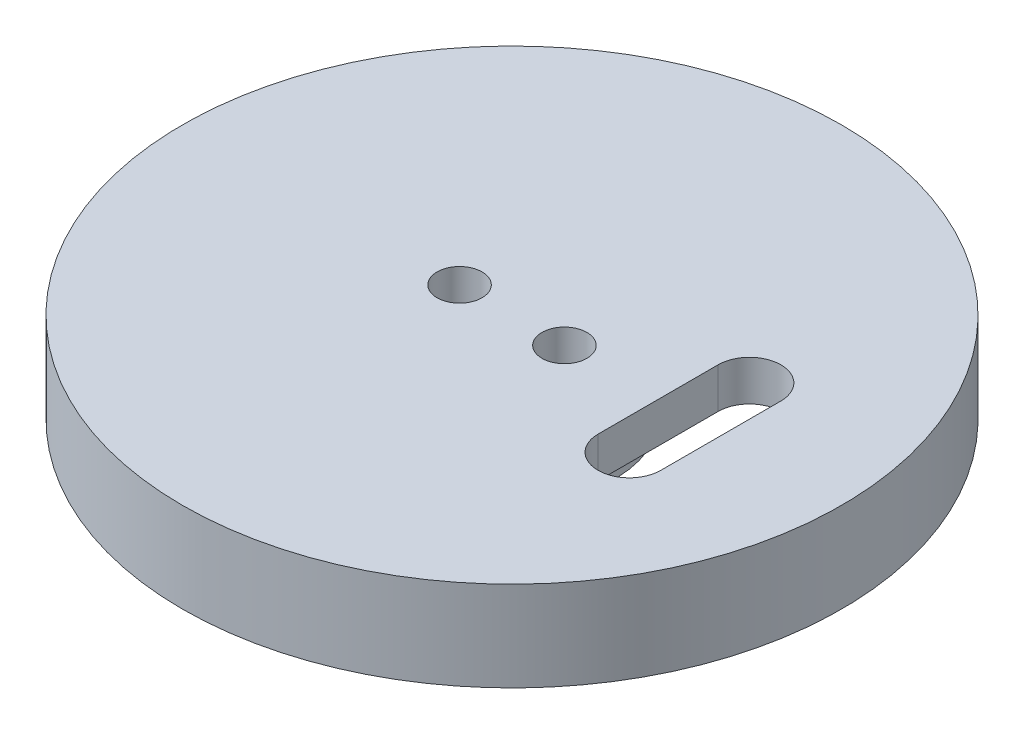
ISO-10303-21;
HEADER;
FILE_DESCRIPTION(('STEP AP214'),'2;1');
FILE_NAME('part.step','',(''),(''),'','','');
FILE_SCHEMA(('AUTOMOTIVE_DESIGN { 1 0 10303 214 1 1 1 1 }'));
ENDSEC;
DATA;
#1=APPLICATION_CONTEXT('core data for automotive mechanical design processes');
#2=APPLICATION_PROTOCOL_DEFINITION('international standard','automotive_design',2000,#1);
#3=PRODUCT_CONTEXT('',#1,'mechanical');
#4=PRODUCT('Part','Part','',(#3));
#5=PRODUCT_RELATED_PRODUCT_CATEGORY('part','',(#4));
#6=PRODUCT_DEFINITION_FORMATION('','',#4);
#7=PRODUCT_DEFINITION_CONTEXT('part definition',#1,'design');
#8=PRODUCT_DEFINITION('design','',#6,#7);
#9=PRODUCT_DEFINITION_SHAPE('','',#8);
#10=(LENGTH_UNIT() NAMED_UNIT(*) SI_UNIT(.MILLI.,.METRE.));
#11=(NAMED_UNIT(*) PLANE_ANGLE_UNIT() SI_UNIT($,.RADIAN.));
#12=(NAMED_UNIT(*) SI_UNIT($,.STERADIAN.) SOLID_ANGLE_UNIT());
#13=UNCERTAINTY_MEASURE_WITH_UNIT(LENGTH_MEASURE(1.E-05),#10,'distance_accuracy_value','');
#14=(GEOMETRIC_REPRESENTATION_CONTEXT(3) GLOBAL_UNCERTAINTY_ASSIGNED_CONTEXT((#13)) GLOBAL_UNIT_ASSIGNED_CONTEXT((#10,
#11,#12)) REPRESENTATION_CONTEXT('',''));
#15=CARTESIAN_POINT('',(0.,0.,0.));
#16=DIRECTION('',(0.,0.,1.));
#17=DIRECTION('',(1.,0.,0.));
#18=AXIS2_PLACEMENT_3D('',#15,#16,#17);
#19=CARTESIAN_POINT('',(0.,0.,0.));
#20=DIRECTION('',(0.,1.,0.));
#21=DIRECTION('',(0.,0.,1.));
#22=AXIS2_PLACEMENT_3D('',#19,#20,#21);
#23=PLANE('',#22);
#24=CARTESIAN_POINT('',(3.5,0.,0.));
#25=DIRECTION('',(0.,1.,0.));
#26=DIRECTION('',(0.,0.,1.));
#27=AXIS2_PLACEMENT_3D('',#24,#25,#26);
#28=CIRCLE('',#27,1.5);
#29=CARTESIAN_POINT('',(3.5,0.,1.5));
#30=VERTEX_POINT('',#29);
#31=EDGE_CURVE('E118',#30,#30,#28,.T.);
#32=ORIENTED_EDGE('',*,*,#31,.T.);
#33=EDGE_LOOP('',(#32));
#34=FACE_BOUND('',#33,.T.);
#35=CARTESIAN_POINT('',(-3.5,0.,0.));
#36=DIRECTION('',(0.,1.,0.));
#37=DIRECTION('',(0.,0.,1.));
#38=AXIS2_PLACEMENT_3D('',#35,#36,#37);
#39=CIRCLE('',#38,1.5);
#40=CARTESIAN_POINT('',(-3.5,0.,1.5));
#41=VERTEX_POINT('',#40);
#42=EDGE_CURVE('E124',#41,#41,#39,.T.);
#43=ORIENTED_EDGE('',*,*,#42,.T.);
#44=EDGE_LOOP('',(#43));
#45=FACE_BOUND('',#44,.T.);
#46=CARTESIAN_POINT('',(0.,0.,0.));
#47=DIRECTION('',(0.,-1.,0.));
#48=DIRECTION('',(0.,0.,-1.));
#49=AXIS2_PLACEMENT_3D('',#46,#47,#48);
#50=CIRCLE('',#49,6.9);
#51=CARTESIAN_POINT('',(0.,0.,-6.9));
#52=VERTEX_POINT('',#51);
#53=EDGE_CURVE('E108',#52,#52,#50,.T.);
#54=ORIENTED_EDGE('',*,*,#53,.T.);
#55=EDGE_LOOP('',(#54));
#56=FACE_BOUND('',#55,.T.);
#57=ADVANCED_FACE('F32',(#34,#45,#56),#23,.F.);
#58=CARTESIAN_POINT('',(0.,6.,0.));
#59=DIRECTION('',(0.,1.,0.));
#60=DIRECTION('',(0.,0.,1.));
#61=AXIS2_PLACEMENT_3D('',#58,#59,#60);
#62=PLANE('',#61);
#63=CARTESIAN_POINT('',(11.8461461549811,6.,4.00867964586304));
#64=DIRECTION('',(0.,1.,0.));
#65=DIRECTION('',(0.,0.,1.));
#66=AXIS2_PLACEMENT_3D('',#63,#64,#65);
#67=CIRCLE('',#66,2.09447963747971);
#68=CARTESIAN_POINT('',(9.75166651750136,6.,4.00867964586304));
#69=VERTEX_POINT('',#68);
#70=CARTESIAN_POINT('',(13.9406257924608,6.,4.00867964586304));
#71=VERTEX_POINT('',#70);
#72=EDGE_CURVE('E106',#69,#71,#67,.T.);
#73=ORIENTED_EDGE('',*,*,#72,.F.);
#74=DIRECTION('',(0.,0.,1.));
#75=VECTOR('',#74,1.);
#76=CARTESIAN_POINT('',(9.75166651750136,6.,0.));
#77=LINE('',#76,#75);
#78=CARTESIAN_POINT('',(9.75166651750136,6.,-4.00867964586304));
#79=VERTEX_POINT('',#78);
#80=EDGE_CURVE('E99',#79,#69,#77,.T.);
#81=ORIENTED_EDGE('',*,*,#80,.F.);
#82=CARTESIAN_POINT('',(11.8461461549811,6.,-4.00867964586304));
#83=DIRECTION('',(0.,1.,0.));
#84=DIRECTION('',(0.,0.,1.));
#85=AXIS2_PLACEMENT_3D('',#82,#83,#84);
#86=CIRCLE('',#85,2.09447963747971);
#87=CARTESIAN_POINT('',(13.9406257924608,6.,-4.00867964586304));
#88=VERTEX_POINT('',#87);
#89=EDGE_CURVE('E79',#88,#79,#86,.T.);
#90=ORIENTED_EDGE('',*,*,#89,.F.);
#91=DIRECTION('',(0.,0.,-1.));
#92=VECTOR('',#91,1.);
#93=CARTESIAN_POINT('',(13.9406257924608,6.,0.));
#94=LINE('',#93,#92);
#95=EDGE_CURVE('E104',#71,#88,#94,.T.);
#96=ORIENTED_EDGE('',*,*,#95,.F.);
#97=EDGE_LOOP('',(#73,#81,#90,#96));
#98=FACE_BOUND('',#97,.T.);
#99=CARTESIAN_POINT('',(-3.5,6.,0.));
#100=DIRECTION('',(0.,1.,0.));
#101=DIRECTION('',(0.,0.,1.));
#102=AXIS2_PLACEMENT_3D('',#99,#100,#101);
#103=CIRCLE('',#102,1.5);
#104=CARTESIAN_POINT('',(-3.5,6.,1.5));
#105=VERTEX_POINT('',#104);
#106=EDGE_CURVE('E127',#105,#105,#103,.T.);
#107=ORIENTED_EDGE('',*,*,#106,.F.);
#108=EDGE_LOOP('',(#107));
#109=FACE_BOUND('',#108,.T.);
#110=CARTESIAN_POINT('',(0.,6.,0.));
#111=DIRECTION('',(0.,1.,0.));
#112=DIRECTION('',(0.,0.,1.));
#113=AXIS2_PLACEMENT_3D('',#110,#111,#112);
#114=CIRCLE('',#113,22.);
#115=CARTESIAN_POINT('',(0.,6.,22.));
#116=VERTEX_POINT('',#115);
#117=EDGE_CURVE('E11',#116,#116,#114,.T.);
#118=ORIENTED_EDGE('',*,*,#117,.T.);
#119=EDGE_LOOP('',(#118));
#120=FACE_BOUND('',#119,.T.);
#121=CARTESIAN_POINT('',(3.5,6.,0.));
#122=DIRECTION('',(0.,1.,0.));
#123=DIRECTION('',(0.,0.,1.));
#124=AXIS2_PLACEMENT_3D('',#121,#122,#123);
#125=CIRCLE('',#124,1.5);
#126=CARTESIAN_POINT('',(3.5,6.,1.5));
#127=VERTEX_POINT('',#126);
#128=EDGE_CURVE('E121',#127,#127,#125,.T.);
#129=ORIENTED_EDGE('',*,*,#128,.F.);
#130=EDGE_LOOP('',(#129));
#131=FACE_BOUND('',#130,.T.);
#132=ADVANCED_FACE('F151',(#98,#109,#120,#131),#62,.T.);
#133=CARTESIAN_POINT('',(0.,0.,0.));
#134=DIRECTION('',(0.,-1.,0.));
#135=DIRECTION('',(0.,0.,-1.));
#136=AXIS2_PLACEMENT_3D('',#133,#134,#135);
#137=CIRCLE('',#136,16.25);
#138=CARTESIAN_POINT('',(0.,0.,-16.25));
#139=VERTEX_POINT('',#138);
#140=EDGE_CURVE('E112',#139,#139,#137,.T.);
#141=ORIENTED_EDGE('',*,*,#140,.F.);
#142=EDGE_LOOP('',(#141));
#143=FACE_BOUND('',#142,.T.);
#144=CARTESIAN_POINT('',(0.,0.,0.));
#145=DIRECTION('',(0.,1.,0.));
#146=DIRECTION('',(0.,0.,1.));
#147=AXIS2_PLACEMENT_3D('',#144,#145,#146);
#148=CIRCLE('',#147,22.);
#149=CARTESIAN_POINT('',(0.,0.,22.));
#150=VERTEX_POINT('',#149);
#151=EDGE_CURVE('E36',#150,#150,#148,.T.);
#152=ORIENTED_EDGE('',*,*,#151,.F.);
#153=EDGE_LOOP('',(#152));
#154=FACE_BOUND('',#153,.T.);
#155=ADVANCED_FACE('F147',(#143,#154),#23,.F.);
#156=CARTESIAN_POINT('',(0.,6.,0.));
#157=DIRECTION('',(0.,-1.,0.));
#158=DIRECTION('',(0.,0.,-1.));
#159=AXIS2_PLACEMENT_3D('',#156,#157,#158);
#160=CYLINDRICAL_SURFACE('',#159,22.);
#161=ORIENTED_EDGE('',*,*,#117,.F.);
#162=EDGE_LOOP('',(#161));
#163=FACE_BOUND('',#162,.T.);
#164=ORIENTED_EDGE('',*,*,#151,.T.);
#165=EDGE_LOOP('',(#164));
#166=FACE_BOUND('',#165,.T.);
#167=ADVANCED_FACE('F34',(#163,#166),#160,.T.);
#168=CARTESIAN_POINT('',(-3.5,6.,0.));
#169=DIRECTION('',(0.,-1.,0.));
#170=DIRECTION('',(0.,0.,-1.));
#171=AXIS2_PLACEMENT_3D('',#168,#169,#170);
#172=CYLINDRICAL_SURFACE('',#171,1.5);
#173=ORIENTED_EDGE('',*,*,#106,.T.);
#174=EDGE_LOOP('',(#173));
#175=FACE_BOUND('',#174,.T.);
#176=ORIENTED_EDGE('',*,*,#42,.F.);
#177=EDGE_LOOP('',(#176));
#178=FACE_BOUND('',#177,.T.);
#179=ADVANCED_FACE('F135',(#175,#178),#172,.F.);
#180=CARTESIAN_POINT('',(3.5,6.,0.));
#181=DIRECTION('',(0.,-1.,0.));
#182=DIRECTION('',(0.,0.,-1.));
#183=AXIS2_PLACEMENT_3D('',#180,#181,#182);
#184=CYLINDRICAL_SURFACE('',#183,1.5);
#185=ORIENTED_EDGE('',*,*,#128,.T.);
#186=EDGE_LOOP('',(#185));
#187=FACE_BOUND('',#186,.T.);
#188=ORIENTED_EDGE('',*,*,#31,.F.);
#189=EDGE_LOOP('',(#188));
#190=FACE_BOUND('',#189,.T.);
#191=ADVANCED_FACE('F137',(#187,#190),#184,.F.);
#192=CARTESIAN_POINT('',(0.,3.3,0.));
#193=DIRECTION('',(0.,-1.,0.));
#194=DIRECTION('',(0.,0.,-1.));
#195=AXIS2_PLACEMENT_3D('',#192,#193,#194);
#196=CYLINDRICAL_SURFACE('',#195,16.25);
#197=CARTESIAN_POINT('',(0.,3.3,0.));
#198=DIRECTION('',(0.,-1.,0.));
#199=DIRECTION('',(0.,0.,-1.));
#200=AXIS2_PLACEMENT_3D('',#197,#198,#199);
#201=CIRCLE('',#200,16.25);
#202=CARTESIAN_POINT('',(0.,3.3,-16.25));
#203=VERTEX_POINT('',#202);
#204=EDGE_CURVE('E115',#203,#203,#201,.T.);
#205=ORIENTED_EDGE('',*,*,#204,.F.);
#206=EDGE_LOOP('',(#205));
#207=FACE_BOUND('',#206,.T.);
#208=ORIENTED_EDGE('',*,*,#140,.T.);
#209=EDGE_LOOP('',(#208));
#210=FACE_BOUND('',#209,.T.);
#211=ADVANCED_FACE('F144',(#207,#210),#196,.F.);
#212=CARTESIAN_POINT('',(0.,3.3,0.));
#213=DIRECTION('',(0.,-1.,0.));
#214=DIRECTION('',(0.,0.,-1.));
#215=AXIS2_PLACEMENT_3D('',#212,#213,#214);
#216=PLANE('',#215);
#217=CARTESIAN_POINT('',(11.8461461549811,3.3,4.00867964586304));
#218=DIRECTION('',(0.,-1.,0.));
#219=DIRECTION('',(0.,0.,-1.));
#220=AXIS2_PLACEMENT_3D('',#217,#218,#219);
#221=CIRCLE('',#220,2.09447963747971);
#222=CARTESIAN_POINT('',(13.9406257924608,3.3,4.00867964586304));
#223=VERTEX_POINT('',#222);
#224=CARTESIAN_POINT('',(9.75166651750136,3.3,4.00867964586304));
#225=VERTEX_POINT('',#224);
#226=EDGE_CURVE('E55',#223,#225,#221,.T.);
#227=ORIENTED_EDGE('',*,*,#226,.F.);
#228=DIRECTION('',(0.,0.,1.));
#229=VECTOR('',#228,1.);
#230=CARTESIAN_POINT('',(13.9406257924608,3.3,4.00867964586304));
#231=LINE('',#230,#229);
#232=CARTESIAN_POINT('',(13.9406257924608,3.3,-4.00867964586304));
#233=VERTEX_POINT('',#232);
#234=EDGE_CURVE('E92',#233,#223,#231,.T.);
#235=ORIENTED_EDGE('',*,*,#234,.F.);
#236=CARTESIAN_POINT('',(11.8461461549811,3.3,-4.00867964586304));
#237=DIRECTION('',(0.,-1.,0.));
#238=DIRECTION('',(0.,0.,-1.));
#239=AXIS2_PLACEMENT_3D('',#236,#237,#238);
#240=CIRCLE('',#239,2.09447963747971);
#241=CARTESIAN_POINT('',(9.75166651750136,3.3,-4.00867964586304));
#242=VERTEX_POINT('',#241);
#243=EDGE_CURVE('E76',#242,#233,#240,.T.);
#244=ORIENTED_EDGE('',*,*,#243,.F.);
#245=DIRECTION('',(0.,0.,-1.));
#246=VECTOR('',#245,1.);
#247=CARTESIAN_POINT('',(9.75166651750136,3.3,4.00867964586304));
#248=LINE('',#247,#246);
#249=EDGE_CURVE('E85',#225,#242,#248,.T.);
#250=ORIENTED_EDGE('',*,*,#249,.F.);
#251=EDGE_LOOP('',(#227,#235,#244,#250));
#252=FACE_BOUND('',#251,.T.);
#253=CARTESIAN_POINT('',(0.,3.3,0.));
#254=DIRECTION('',(0.,-1.,0.));
#255=DIRECTION('',(0.,0.,-1.));
#256=AXIS2_PLACEMENT_3D('',#253,#254,#255);
#257=CIRCLE('',#256,6.9);
#258=CARTESIAN_POINT('',(0.,3.3,-6.9));
#259=VERTEX_POINT('',#258);
#260=EDGE_CURVE('E109',#259,#259,#257,.T.);
#261=ORIENTED_EDGE('',*,*,#260,.F.);
#262=EDGE_LOOP('',(#261));
#263=FACE_BOUND('',#262,.T.);
#264=ORIENTED_EDGE('',*,*,#204,.T.);
#265=EDGE_LOOP('',(#264));
#266=FACE_BOUND('',#265,.T.);
#267=ADVANCED_FACE('F89',(#252,#263,#266),#216,.T.);
#268=CARTESIAN_POINT('',(0.,3.3,0.));
#269=DIRECTION('',(0.,-1.,0.));
#270=DIRECTION('',(0.,0.,-1.));
#271=AXIS2_PLACEMENT_3D('',#268,#269,#270);
#272=CYLINDRICAL_SURFACE('',#271,6.9);
#273=ORIENTED_EDGE('',*,*,#260,.T.);
#274=EDGE_LOOP('',(#273));
#275=FACE_BOUND('',#274,.T.);
#276=ORIENTED_EDGE('',*,*,#53,.F.);
#277=EDGE_LOOP('',(#276));
#278=FACE_BOUND('',#277,.T.);
#279=ADVANCED_FACE('F173',(#275,#278),#272,.T.);
#280=CARTESIAN_POINT('',(11.8461461549811,6.3,4.00867964586304));
#281=DIRECTION('',(0.,-1.,0.));
#282=DIRECTION('',(0.,0.,-1.));
#283=AXIS2_PLACEMENT_3D('',#280,#281,#282);
#284=CYLINDRICAL_SURFACE('',#283,2.09447963747971);
#285=ORIENTED_EDGE('',*,*,#72,.T.);
#286=DIRECTION('',(0.,-1.,0.));
#287=VECTOR('',#286,1.);
#288=CARTESIAN_POINT('',(13.9406257924608,6.3,4.00867964586304));
#289=LINE('',#288,#287);
#290=EDGE_CURVE('E97',#71,#223,#289,.T.);
#291=ORIENTED_EDGE('',*,*,#290,.T.);
#292=ORIENTED_EDGE('',*,*,#226,.T.);
#293=DIRECTION('',(0.,-1.,0.));
#294=VECTOR('',#293,1.);
#295=CARTESIAN_POINT('',(9.75166651750136,6.3,4.00867964586304));
#296=LINE('',#295,#294);
#297=EDGE_CURVE('E82',#69,#225,#296,.T.);
#298=ORIENTED_EDGE('',*,*,#297,.F.);
#299=EDGE_LOOP('',(#285,#291,#292,#298));
#300=FACE_BOUND('',#299,.T.);
#301=ADVANCED_FACE('F179',(#300),#284,.F.);
#302=CARTESIAN_POINT('',(13.9406257924608,6.3,4.00867964586304));
#303=DIRECTION('',(1.,0.,0.));
#304=DIRECTION('',(0.,0.,-1.));
#305=AXIS2_PLACEMENT_3D('',#302,#303,#304);
#306=PLANE('',#305);
#307=ORIENTED_EDGE('',*,*,#95,.T.);
#308=DIRECTION('',(0.,-1.,0.));
#309=VECTOR('',#308,1.);
#310=CARTESIAN_POINT('',(13.9406257924608,6.3,-4.00867964586304));
#311=LINE('',#310,#309);
#312=EDGE_CURVE('E81',#88,#233,#311,.T.);
#313=ORIENTED_EDGE('',*,*,#312,.T.);
#314=ORIENTED_EDGE('',*,*,#234,.T.);
#315=ORIENTED_EDGE('',*,*,#290,.F.);
#316=EDGE_LOOP('',(#307,#313,#314,#315));
#317=FACE_BOUND('',#316,.T.);
#318=ADVANCED_FACE('F183',(#317),#306,.F.);
#319=CARTESIAN_POINT('',(11.8461461549811,6.3,-4.00867964586304));
#320=DIRECTION('',(0.,-1.,0.));
#321=DIRECTION('',(0.,0.,-1.));
#322=AXIS2_PLACEMENT_3D('',#319,#320,#321);
#323=CYLINDRICAL_SURFACE('',#322,2.09447963747971);
#324=ORIENTED_EDGE('',*,*,#89,.T.);
#325=DIRECTION('',(0.,-1.,0.));
#326=VECTOR('',#325,1.);
#327=CARTESIAN_POINT('',(9.75166651750136,6.3,-4.00867964586304));
#328=LINE('',#327,#326);
#329=EDGE_CURVE('E47',#79,#242,#328,.T.);
#330=ORIENTED_EDGE('',*,*,#329,.T.);
#331=ORIENTED_EDGE('',*,*,#243,.T.);
#332=ORIENTED_EDGE('',*,*,#312,.F.);
#333=EDGE_LOOP('',(#324,#330,#331,#332));
#334=FACE_BOUND('',#333,.T.);
#335=ADVANCED_FACE('F73',(#334),#323,.F.);
#336=CARTESIAN_POINT('',(9.75166651750136,6.3,4.00867964586304));
#337=DIRECTION('',(-1.,0.,0.));
#338=DIRECTION('',(0.,0.,1.));
#339=AXIS2_PLACEMENT_3D('',#336,#337,#338);
#340=PLANE('',#339);
#341=ORIENTED_EDGE('',*,*,#80,.T.);
#342=ORIENTED_EDGE('',*,*,#297,.T.);
#343=ORIENTED_EDGE('',*,*,#249,.T.);
#344=ORIENTED_EDGE('',*,*,#329,.F.);
#345=EDGE_LOOP('',(#341,#342,#343,#344));
#346=FACE_BOUND('',#345,.T.);
#347=ADVANCED_FACE('F86',(#346),#340,.F.);
#348=CLOSED_SHELL('',(#57,#132,#155,#167,#179,#191,#211,#267,#279,#301,#318,#335,#347));
#349=MANIFOLD_SOLID_BREP('B2',#348);
#350=ADVANCED_BREP_SHAPE_REPRESENTATION('',(#18,#349),#14);
#351=SHAPE_DEFINITION_REPRESENTATION(#9,#350);
ENDSEC;
END-ISO-10303-21;
